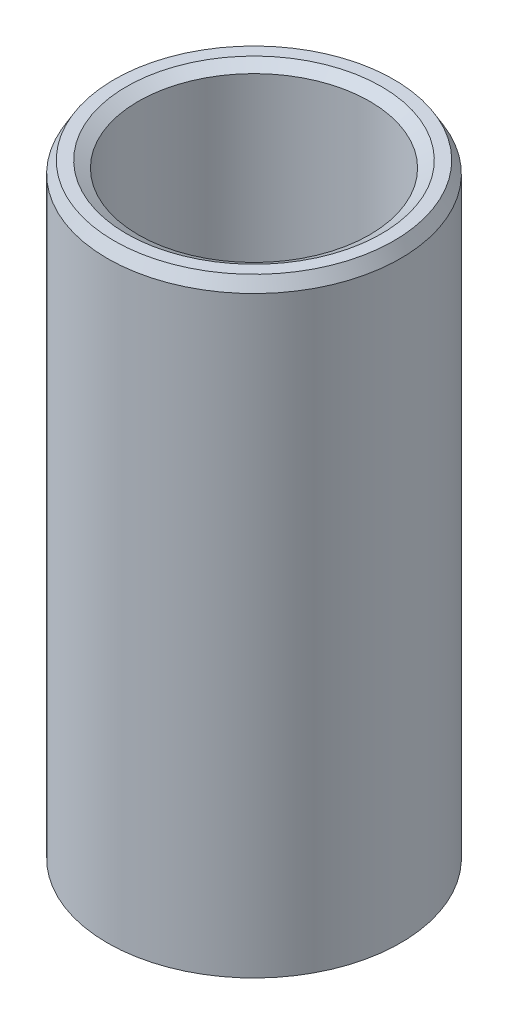
ISO-10303-21;
HEADER;
FILE_DESCRIPTION(('STEP AP214'),'2;1');
FILE_NAME('part.step','',(''),(''),'','','');
FILE_SCHEMA(('AUTOMOTIVE_DESIGN { 1 0 10303 214 1 1 1 1 }'));
ENDSEC;
DATA;
#1=APPLICATION_CONTEXT('core data for automotive mechanical design processes');
#2=APPLICATION_PROTOCOL_DEFINITION('international standard','automotive_design',2000,#1);
#3=PRODUCT_CONTEXT('',#1,'mechanical');
#4=PRODUCT('Part','Part','',(#3));
#5=PRODUCT_RELATED_PRODUCT_CATEGORY('part','',(#4));
#6=PRODUCT_DEFINITION_FORMATION('','',#4);
#7=PRODUCT_DEFINITION_CONTEXT('part definition',#1,'design');
#8=PRODUCT_DEFINITION('design','',#6,#7);
#9=PRODUCT_DEFINITION_SHAPE('','',#8);
#10=(LENGTH_UNIT() NAMED_UNIT(*) SI_UNIT(.MILLI.,.METRE.));
#11=(NAMED_UNIT(*) PLANE_ANGLE_UNIT() SI_UNIT($,.RADIAN.));
#12=(NAMED_UNIT(*) SI_UNIT($,.STERADIAN.) SOLID_ANGLE_UNIT());
#13=UNCERTAINTY_MEASURE_WITH_UNIT(LENGTH_MEASURE(1.E-05),#10,'distance_accuracy_value','');
#14=(GEOMETRIC_REPRESENTATION_CONTEXT(3) GLOBAL_UNCERTAINTY_ASSIGNED_CONTEXT((#13)) GLOBAL_UNIT_ASSIGNED_CONTEXT((#10,
#11,#12)) REPRESENTATION_CONTEXT('',''));
#15=CARTESIAN_POINT('',(0.,0.,0.));
#16=DIRECTION('',(0.,0.,1.));
#17=DIRECTION('',(1.,0.,0.));
#18=AXIS2_PLACEMENT_3D('',#15,#16,#17);
#19=CARTESIAN_POINT('',(0.,83.3828365478898,0.));
#20=DIRECTION('',(0.,-1.,0.));
#21=DIRECTION('',(0.,0.,-1.));
#22=AXIS2_PLACEMENT_3D('',#19,#20,#21);
#23=CYLINDRICAL_SURFACE('',#22,20.);
#24=CARTESIAN_POINT('',(0.,0.930963076582761,0.));
#25=DIRECTION('',(0.,1.,0.));
#26=DIRECTION('',(0.,0.,1.));
#27=AXIS2_PLACEMENT_3D('',#24,#25,#26);
#28=CIRCLE('',#27,20.);
#29=CARTESIAN_POINT('',(0.,0.930963076582761,20.));
#30=VERTEX_POINT('',#29);
#31=EDGE_CURVE('E10',#30,#30,#28,.T.);
#32=ORIENTED_EDGE('',*,*,#31,.T.);
#33=EDGE_LOOP('',(#32));
#34=FACE_BOUND('',#33,.T.);
#35=CARTESIAN_POINT('',(0.,81.7703611992778,0.));
#36=DIRECTION('',(0.,1.,0.));
#37=DIRECTION('',(0.,0.,1.));
#38=AXIS2_PLACEMENT_3D('',#35,#36,#37);
#39=CIRCLE('',#38,20.);
#40=CARTESIAN_POINT('',(0.,81.7703611992778,20.));
#41=VERTEX_POINT('',#40);
#42=EDGE_CURVE('E50',#41,#41,#39,.F.);
#43=ORIENTED_EDGE('',*,*,#42,.T.);
#44=EDGE_LOOP('',(#43));
#45=FACE_BOUND('',#44,.T.);
#46=ADVANCED_FACE('F39',(#34,#45),#23,.T.);
#47=CARTESIAN_POINT('',(0.,83.3828365478898,0.));
#48=DIRECTION('',(0.,1.,0.));
#49=DIRECTION('',(0.,0.,1.));
#50=AXIS2_PLACEMENT_3D('',#47,#48,#49);
#51=PLANE('',#50);
#52=CARTESIAN_POINT('',(0.,83.3828365478898,0.));
#53=DIRECTION('',(0.,1.,0.));
#54=DIRECTION('',(0.,0.,1.));
#55=AXIS2_PLACEMENT_3D('',#52,#53,#54);
#56=CIRCLE('',#55,17.3892914516569);
#57=CARTESIAN_POINT('',(0.,83.3828365478898,17.3892914516569));
#58=VERTEX_POINT('',#57);
#59=EDGE_CURVE('E58',#58,#58,#56,.F.);
#60=ORIENTED_EDGE('',*,*,#59,.T.);
#61=EDGE_LOOP('',(#60));
#62=FACE_BOUND('',#61,.T.);
#63=CARTESIAN_POINT('',(0.,83.3828365478898,0.));
#64=DIRECTION('',(0.,1.,0.));
#65=DIRECTION('',(0.,0.,1.));
#66=AXIS2_PLACEMENT_3D('',#63,#64,#65);
#67=CIRCLE('',#66,19.0690369234172);
#68=CARTESIAN_POINT('',(0.,83.3828365478898,19.0690369234172));
#69=VERTEX_POINT('',#68);
#70=EDGE_CURVE('E61',#69,#69,#67,.T.);
#71=ORIENTED_EDGE('',*,*,#70,.T.);
#72=EDGE_LOOP('',(#71));
#73=FACE_BOUND('',#72,.T.);
#74=ADVANCED_FACE('F88',(#62,#73),#51,.T.);
#75=CARTESIAN_POINT('',(0.,0.,0.));
#76=DIRECTION('',(0.,1.,0.));
#77=DIRECTION('',(0.,0.,1.));
#78=AXIS2_PLACEMENT_3D('',#75,#76,#77);
#79=PLANE('',#78);
#80=CARTESIAN_POINT('',(0.,0.,0.));
#81=DIRECTION('',(0.,1.,0.));
#82=DIRECTION('',(0.,0.,1.));
#83=AXIS2_PLACEMENT_3D('',#80,#81,#82);
#84=CIRCLE('',#83,16.7077791796277);
#85=CARTESIAN_POINT('',(0.,0.,-16.7077791796277));
#86=VERTEX_POINT('',#85);
#87=EDGE_CURVE('E51',#86,#86,#84,.T.);
#88=ORIENTED_EDGE('',*,*,#87,.T.);
#89=EDGE_LOOP('',(#88));
#90=FACE_BOUND('',#89,.T.);
#91=CARTESIAN_POINT('',(0.,0.,0.));
#92=DIRECTION('',(0.,1.,0.));
#93=DIRECTION('',(0.,0.,1.));
#94=AXIS2_PLACEMENT_3D('',#91,#92,#93);
#95=CIRCLE('',#94,18.387524651388);
#96=CARTESIAN_POINT('',(0.,0.,18.387524651388));
#97=VERTEX_POINT('',#96);
#98=EDGE_CURVE('E54',#97,#97,#95,.F.);
#99=ORIENTED_EDGE('',*,*,#98,.T.);
#100=EDGE_LOOP('',(#99));
#101=FACE_BOUND('',#100,.T.);
#102=ADVANCED_FACE('F83',(#90,#101),#79,.F.);
#103=CARTESIAN_POINT('',(0.,83.3828365478898,0.));
#104=DIRECTION('',(0.,-1.,0.));
#105=DIRECTION('',(0.,0.,-1.));
#106=AXIS2_PLACEMENT_3D('',#103,#104,#105);
#107=CYLINDRICAL_SURFACE('',#106,15.776816103045);
#108=CARTESIAN_POINT('',(0.,82.451873471307,0.));
#109=DIRECTION('',(0.,1.,0.));
#110=DIRECTION('',(0.,0.,1.));
#111=AXIS2_PLACEMENT_3D('',#108,#109,#110);
#112=CIRCLE('',#111,15.776816103045);
#113=CARTESIAN_POINT('',(0.,82.451873471307,15.776816103045));
#114=VERTEX_POINT('',#113);
#115=EDGE_CURVE('E67',#114,#114,#112,.T.);
#116=ORIENTED_EDGE('',*,*,#115,.T.);
#117=EDGE_LOOP('',(#116));
#118=FACE_BOUND('',#117,.T.);
#119=CARTESIAN_POINT('',(0.,1.612475348612,0.));
#120=DIRECTION('',(0.,1.,0.));
#121=DIRECTION('',(0.,0.,1.));
#122=AXIS2_PLACEMENT_3D('',#119,#120,#121);
#123=CIRCLE('',#122,15.776816103045);
#124=CARTESIAN_POINT('',(0.,1.612475348612,-15.776816103045));
#125=VERTEX_POINT('',#124);
#126=EDGE_CURVE('E69',#125,#125,#123,.F.);
#127=ORIENTED_EDGE('',*,*,#126,.T.);
#128=EDGE_LOOP('',(#127));
#129=FACE_BOUND('',#128,.T.);
#130=ADVANCED_FACE('F71',(#118,#129),#107,.F.);
#131=CARTESIAN_POINT('',(0.,82.451873471307,0.));
#132=DIRECTION('',(0.,1.,0.));
#133=DIRECTION('',(0.,0.,1.));
#134=AXIS2_PLACEMENT_3D('',#131,#132,#133);
#135=CONICAL_SURFACE('',#134,15.776816103045,1.0471975511966);
#136=ORIENTED_EDGE('',*,*,#59,.F.);
#137=EDGE_LOOP('',(#136));
#138=FACE_BOUND('',#137,.T.);
#139=ORIENTED_EDGE('',*,*,#115,.F.);
#140=EDGE_LOOP('',(#139));
#141=FACE_BOUND('',#140,.T.);
#142=ADVANCED_FACE('F77',(#138,#141),#135,.F.);
#143=CARTESIAN_POINT('',(0.,0.,0.));
#144=DIRECTION('',(0.,-1.,0.));
#145=DIRECTION('',(0.,0.,-1.));
#146=AXIS2_PLACEMENT_3D('',#143,#144,#145);
#147=CONICAL_SURFACE('',#146,16.7077791796277,0.523598775598297);
#148=CARTESIAN_POINT('',(0.,1.612475348612,-15.776816103045));
#149=CARTESIAN_POINT('',(0.,1.59567873039729,-15.7865136350927));
#150=CARTESIAN_POINT('',(0.,1.57888211218259,-15.7962111671404));
#151=CARTESIAN_POINT('',(0.,1.54528887575317,-15.8156062312359));
#152=CARTESIAN_POINT('',(0.,1.52849225753846,-15.8253037632836));
#153=CARTESIAN_POINT('',(0.,1.49489902110904,-15.8446988273791));
#154=CARTESIAN_POINT('',(0.,1.47810240289434,-15.8543963594268));
#155=CARTESIAN_POINT('',(0.,1.44450916646492,-15.8737914235223));
#156=CARTESIAN_POINT('',(0.,1.42771254825021,-15.8834889555701));
#157=CARTESIAN_POINT('',(0.,1.39411931182079,-15.9028840196655));
#158=CARTESIAN_POINT('',(0.,1.37732269360609,-15.9125815517133));
#159=CARTESIAN_POINT('',(0.,1.34372945717667,-15.9319766158087));
#160=CARTESIAN_POINT('',(0.,1.32693283896196,-15.9416741478565));
#161=CARTESIAN_POINT('',(0.,1.29333960253254,-15.961069211952));
#162=CARTESIAN_POINT('',(0.,1.27654298431784,-15.9707667439997));
#163=CARTESIAN_POINT('',(0.,1.24294974788842,-15.9901618080952));
#164=CARTESIAN_POINT('',(0.,1.22615312967371,-15.9998593401429));
#165=CARTESIAN_POINT('',(0.,1.19255989324429,-16.0192544042384));
#166=CARTESIAN_POINT('',(0.,1.17576327502958,-16.0289519362861));
#167=CARTESIAN_POINT('',(0.,1.14217003860017,-16.0483470003816));
#168=CARTESIAN_POINT('',(0.,1.12537342038546,-16.0580445324293));
#169=CARTESIAN_POINT('',(0.,1.09178018395604,-16.0774395965248));
#170=CARTESIAN_POINT('',(0.,1.07498356574133,-16.0871371285725));
#171=CARTESIAN_POINT('',(0.,1.04139032931192,-16.106532192668));
#172=CARTESIAN_POINT('',(0.,1.02459371109721,-16.1162297247158));
#173=CARTESIAN_POINT('',(0.,0.991000474667793,-16.1356247888112));
#174=CARTESIAN_POINT('',(0.,0.974203856453084,-16.145322320859));
#175=CARTESIAN_POINT('',(0.,0.940610620023668,-16.1647173849544));
#176=CARTESIAN_POINT('',(0.,0.923814001808959,-16.1744149170022));
#177=CARTESIAN_POINT('',(0.,0.890220765379543,-16.1938099810977));
#178=CARTESIAN_POINT('',(0.,0.873424147164835,-16.2035075131454));
#179=CARTESIAN_POINT('',(0.,0.839830910735418,-16.2229025772409));
#180=CARTESIAN_POINT('',(0.,0.823034292520709,-16.2326001092886));
#181=CARTESIAN_POINT('',(0.,0.789441056091293,-16.2519951733841));
#182=CARTESIAN_POINT('',(0.,0.772644437876584,-16.2616927054318));
#183=CARTESIAN_POINT('',(0.,0.739051201447168,-16.2810877695273));
#184=CARTESIAN_POINT('',(0.,0.722254583232459,-16.290785301575));
#185=CARTESIAN_POINT('',(0.,0.688661346803043,-16.3101803656705));
#186=CARTESIAN_POINT('',(0.,0.671864728588335,-16.3198778977182));
#187=CARTESIAN_POINT('',(0.,0.638271492158918,-16.3392729618137));
#188=CARTESIAN_POINT('',(0.,0.621474873944209,-16.3489704938614));
#189=CARTESIAN_POINT('',(0.,0.587881637514792,-16.3683655579569));
#190=CARTESIAN_POINT('',(0.,0.571085019300084,-16.3780630900047));
#191=CARTESIAN_POINT('',(0.,0.537491782870667,-16.3974581541001));
#192=CARTESIAN_POINT('',(0.,0.520695164655959,-16.4071556861479));
#193=CARTESIAN_POINT('',(0.,0.487101928226542,-16.4265507502433));
#194=CARTESIAN_POINT('',(0.,0.470305310011834,-16.4362482822911));
#195=CARTESIAN_POINT('',(0.,0.436712073582417,-16.4556433463866));
#196=CARTESIAN_POINT('',(0.,0.419915455367709,-16.4653408784343));
#197=CARTESIAN_POINT('',(0.,0.386322218938292,-16.4847359425298));
#198=CARTESIAN_POINT('',(0.,0.369525600723584,-16.4944334745775));
#199=CARTESIAN_POINT('',(0.,0.335932364294167,-16.513828538673));
#200=CARTESIAN_POINT('',(0.,0.319135746079459,-16.5235260707207));
#201=CARTESIAN_POINT('',(0.,0.285542509650042,-16.5429211348162));
#202=CARTESIAN_POINT('',(0.,0.268745891435334,-16.5526186668639));
#203=CARTESIAN_POINT('',(0.,0.235152655005917,-16.5720137309594));
#204=CARTESIAN_POINT('',(0.,0.218356036791209,-16.5817112630071));
#205=CARTESIAN_POINT('',(0.,0.184762800361792,-16.6011063271026));
#206=CARTESIAN_POINT('',(0.,0.167966182147084,-16.6108038591503));
#207=CARTESIAN_POINT('',(0.,0.134372945717667,-16.6301989232458));
#208=CARTESIAN_POINT('',(0.,0.117576327502959,-16.6398964552936));
#209=CARTESIAN_POINT('',(0.,0.083983091073542,-16.659291519389));
#210=CARTESIAN_POINT('',(0.,0.0671864728588334,-16.6689890514368));
#211=CARTESIAN_POINT('',(0.,0.0335932364294162,-16.6883841155322));
#212=CARTESIAN_POINT('',(0.,0.0167966182147076,-16.69808164758));
#213=CARTESIAN_POINT('',(0.,0.,-16.7077791796277));
#214=B_SPLINE_CURVE_WITH_KNOTS('',3,(#148,#149,#150,#151,#152,#153,#154,#155,#156,#157,#158,
#159,#160,#161,#162,#163,#164,#165,#166,#167,#168,#169,#170,#171,#172,#173,#174,#175,#176,#177,
#178,#179,#180,#181,#182,#183,#184,#185,#186,#187,#188,#189,#190,#191,#192,#193,#194,#195,#196,
#197,#198,#199,#200,#201,#202,#203,#204,#205,#206,#207,#208,#209,#210,#211,#212,#213),
.UNSPECIFIED.,.F.,.F.,(4,2,2,2,2,2,2,2,2,2,2,2,2,2,2,2,2,2,2,2,2,2,2,2,2,2,2,2,2,2,2,2,4),(0.,
0.0581851922864239,0.116370384572846,0.17455557685927,0.232740769145694,0.290925961432118,
0.34911115371854,0.407296346004964,0.465481538291387,0.52366673057781,0.581851922864233,
0.640037115150657,0.698222307437081,0.756407499723503,0.814592692009927,0.872777884296351,
0.930963076582773,0.989148268869197,1.04733346115562,1.10551865344204,1.16370384572847,
1.22188903801489,1.28007423030131,1.33825942258774,1.39644461487416,1.45462980716058,
1.51281499944701,1.57100019173343,1.62918538401985,1.68737057630628,1.7455557685927,
1.80374096087912,1.86192615316555),.UNSPECIFIED.);
#215=EDGE_CURVE('BSEAM73',#125,#86,#214,.T.);
#216=ORIENTED_EDGE('',*,*,#126,.F.);
#217=ORIENTED_EDGE('',*,*,#87,.F.);
#218=ORIENTED_EDGE('',*,*,#215,.T.);
#219=ORIENTED_EDGE('',*,*,#215,.F.);
#220=EDGE_LOOP('',(#216,#218,#217,#219));
#221=FACE_BOUND('',#220,.T.);
#222=ADVANCED_FACE('F73',(#221),#147,.F.);
#223=CARTESIAN_POINT('',(0.,0.930963076582761,0.));
#224=DIRECTION('',(0.,1.,0.));
#225=DIRECTION('',(0.,0.,1.));
#226=AXIS2_PLACEMENT_3D('',#223,#224,#225);
#227=CONICAL_SURFACE('',#226,20.,1.0471975511966);
#228=ORIENTED_EDGE('',*,*,#98,.F.);
#229=EDGE_LOOP('',(#228));
#230=FACE_BOUND('',#229,.T.);
#231=ORIENTED_EDGE('',*,*,#31,.F.);
#232=EDGE_LOOP('',(#231));
#233=FACE_BOUND('',#232,.T.);
#234=ADVANCED_FACE('F76',(#230,#233),#227,.T.);
#235=CARTESIAN_POINT('',(0.,83.3828365478898,0.));
#236=DIRECTION('',(0.,-1.,0.));
#237=DIRECTION('',(0.,0.,-1.));
#238=AXIS2_PLACEMENT_3D('',#235,#236,#237);
#239=CONICAL_SURFACE('',#238,19.0690369234172,0.523598775598296);
#240=ORIENTED_EDGE('',*,*,#42,.F.);
#241=EDGE_LOOP('',(#240));
#242=FACE_BOUND('',#241,.T.);
#243=ORIENTED_EDGE('',*,*,#70,.F.);
#244=EDGE_LOOP('',(#243));
#245=FACE_BOUND('',#244,.T.);
#246=ADVANCED_FACE('F45',(#242,#245),#239,.T.);
#247=CLOSED_SHELL('',(#46,#74,#102,#130,#142,#222,#234,#246));
#248=MANIFOLD_SOLID_BREP('B2',#247);
#249=ADVANCED_BREP_SHAPE_REPRESENTATION('',(#18,#248),#14);
#250=SHAPE_DEFINITION_REPRESENTATION(#9,#249);
ENDSEC;
END-ISO-10303-21;
